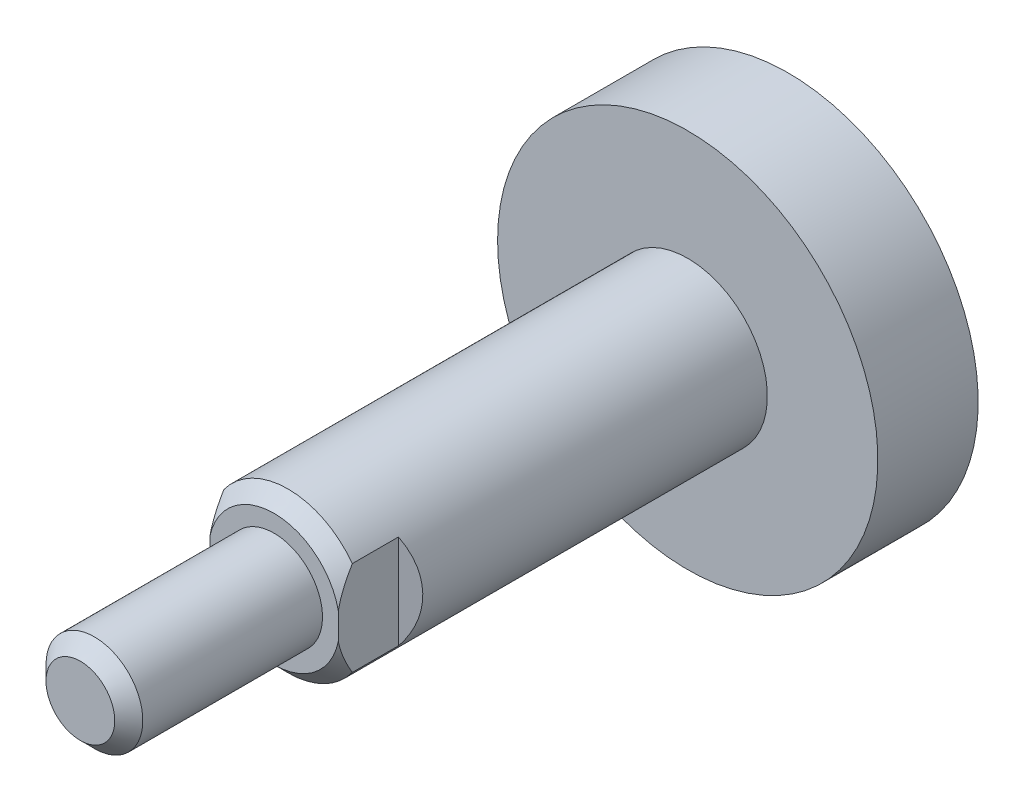
ISO-10303-21;
HEADER;
FILE_DESCRIPTION(('STEP AP214'),'2;1');
FILE_NAME('part.step','',(''),(''),'','','');
FILE_SCHEMA(('AUTOMOTIVE_DESIGN { 1 0 10303 214 1 1 1 1 }'));
ENDSEC;
DATA;
#1=APPLICATION_CONTEXT('core data for automotive mechanical design processes');
#2=APPLICATION_PROTOCOL_DEFINITION('international standard','automotive_design',2000,#1);
#3=PRODUCT_CONTEXT('',#1,'mechanical');
#4=PRODUCT('Part','Part','',(#3));
#5=PRODUCT_RELATED_PRODUCT_CATEGORY('part','',(#4));
#6=PRODUCT_DEFINITION_FORMATION('','',#4);
#7=PRODUCT_DEFINITION_CONTEXT('part definition',#1,'design');
#8=PRODUCT_DEFINITION('design','',#6,#7);
#9=PRODUCT_DEFINITION_SHAPE('','',#8);
#10=(LENGTH_UNIT() NAMED_UNIT(*) SI_UNIT(.MILLI.,.METRE.));
#11=(NAMED_UNIT(*) PLANE_ANGLE_UNIT() SI_UNIT($,.RADIAN.));
#12=(NAMED_UNIT(*) SI_UNIT($,.STERADIAN.) SOLID_ANGLE_UNIT());
#13=UNCERTAINTY_MEASURE_WITH_UNIT(LENGTH_MEASURE(1.E-05),#10,'distance_accuracy_value','');
#14=(GEOMETRIC_REPRESENTATION_CONTEXT(3) GLOBAL_UNCERTAINTY_ASSIGNED_CONTEXT((#13)) GLOBAL_UNIT_ASSIGNED_CONTEXT((#10,
#11,#12)) REPRESENTATION_CONTEXT('',''));
#15=CARTESIAN_POINT('',(0.,0.,0.));
#16=DIRECTION('',(0.,0.,1.));
#17=DIRECTION('',(1.,0.,0.));
#18=AXIS2_PLACEMENT_3D('',#15,#16,#17);
#19=CARTESIAN_POINT('',(0.,0.,35.266));
#20=DIRECTION('',(0.,0.,1.));
#21=DIRECTION('',(1.,0.,0.));
#22=AXIS2_PLACEMENT_3D('',#19,#20,#21);
#23=PLANE('',#22);
#24=CARTESIAN_POINT('',(0.,0.,35.2659999999219));
#25=DIRECTION('',(0.,0.,-1.));
#26=DIRECTION('',(-1.,0.,0.));
#27=AXIS2_PLACEMENT_3D('',#24,#25,#26);
#28=CIRCLE('',#27,1.71299999999519);
#29=CARTESIAN_POINT('',(-1.71299999999519,0.,35.2659999999219));
#30=VERTEX_POINT('',#29);
#31=EDGE_CURVE('E20',#30,#30,#28,.T.);
#32=ORIENTED_EDGE('',*,*,#31,.F.);
#33=EDGE_LOOP('',(#32));
#34=FACE_BOUND('',#33,.T.);
#35=ADVANCED_FACE('F17',(#34),#23,.T.);
#36=CARTESIAN_POINT('',(0.,0.,34.5659999999839));
#37=DIRECTION('',(0.,0.,-1.));
#38=DIRECTION('',(-1.,0.,0.));
#39=AXIS2_PLACEMENT_3D('',#36,#37,#38);
#40=CONICAL_SURFACE('',#39,2.41299999993316,0.785398163397448);
#41=ORIENTED_EDGE('',*,*,#31,.T.);
#42=EDGE_LOOP('',(#41));
#43=FACE_BOUND('',#42,.T.);
#44=CARTESIAN_POINT('',(0.,0.,34.566));
#45=DIRECTION('',(0.,0.,-1.));
#46=DIRECTION('',(-1.,0.,0.));
#47=AXIS2_PLACEMENT_3D('',#44,#45,#46);
#48=CIRCLE('',#47,2.413);
#49=CARTESIAN_POINT('',(-2.413,0.,34.566));
#50=VERTEX_POINT('',#49);
#51=EDGE_CURVE('E72',#50,#50,#48,.T.);
#52=ORIENTED_EDGE('',*,*,#51,.F.);
#53=EDGE_LOOP('',(#52));
#54=FACE_BOUND('',#53,.T.);
#55=ADVANCED_FACE('F197',(#43,#54),#40,.T.);
#56=CARTESIAN_POINT('',(0.,0.,35.266));
#57=DIRECTION('',(0.,0.,-1.));
#58=DIRECTION('',(-1.,0.,0.));
#59=AXIS2_PLACEMENT_3D('',#56,#57,#58);
#60=CYLINDRICAL_SURFACE('',#59,2.413);
#61=ORIENTED_EDGE('',*,*,#51,.T.);
#62=EDGE_LOOP('',(#61));
#63=FACE_BOUND('',#62,.T.);
#64=CARTESIAN_POINT('',(0.,0.,25.614));
#65=DIRECTION('',(0.,0.,-1.));
#66=DIRECTION('',(-1.,0.,0.));
#67=AXIS2_PLACEMENT_3D('',#64,#65,#66);
#68=CIRCLE('',#67,2.413);
#69=CARTESIAN_POINT('',(-2.413,0.,25.614));
#70=VERTEX_POINT('',#69);
#71=EDGE_CURVE('E71',#70,#70,#68,.F.);
#72=ORIENTED_EDGE('',*,*,#71,.T.);
#73=EDGE_LOOP('',(#72));
#74=FACE_BOUND('',#73,.T.);
#75=ADVANCED_FACE('F205',(#63,#74),#60,.T.);
#76=CARTESIAN_POINT('',(0.,0.,25.614));
#77=DIRECTION('',(0.,0.,-1.));
#78=DIRECTION('',(-1.,0.,0.));
#79=AXIS2_PLACEMENT_3D('',#76,#77,#78);
#80=PLANE('',#79);
#81=ORIENTED_EDGE('',*,*,#71,.F.);
#82=EDGE_LOOP('',(#81));
#83=FACE_BOUND('',#82,.T.);
#84=DIRECTION('',(0.,1.,0.));
#85=VECTOR('',#84,1.);
#86=CARTESIAN_POINT('',(3.2,0.,25.614));
#87=LINE('',#86,#85);
#88=CARTESIAN_POINT('',(3.2,0.668102537031743,25.6140000000093));
#89=VERTEX_POINT('',#88);
#90=CARTESIAN_POINT('',(3.2,-0.668102537031746,25.6140000000093));
#91=VERTEX_POINT('',#90);
#92=EDGE_CURVE('E59',#89,#91,#87,.F.);
#93=ORIENTED_EDGE('',*,*,#92,.F.);
#94=CARTESIAN_POINT('',(0.,0.,25.6140000000187));
#95=DIRECTION('',(0.,0.,-1.));
#96=DIRECTION('',(0.,1.,0.));
#97=AXIS2_PLACEMENT_3D('',#94,#95,#96);
#98=CIRCLE('',#97,3.26899999998886);
#99=CARTESIAN_POINT('',(-3.2,0.668102537031739,25.6140000000093));
#100=VERTEX_POINT('',#99);
#101=EDGE_CURVE('E92',#100,#89,#98,.T.);
#102=ORIENTED_EDGE('',*,*,#101,.F.);
#103=DIRECTION('',(0.,1.,0.));
#104=VECTOR('',#103,1.);
#105=CARTESIAN_POINT('',(-3.2,-9.475,25.614));
#106=LINE('',#105,#104);
#107=CARTESIAN_POINT('',(-3.2,-0.668102537013467,25.6140000000131));
#108=VERTEX_POINT('',#107);
#109=EDGE_CURVE('E78',#100,#108,#106,.F.);
#110=ORIENTED_EDGE('',*,*,#109,.T.);
#111=CARTESIAN_POINT('',(0.,0.,25.6140000000187));
#112=DIRECTION('',(0.,0.,-1.));
#113=DIRECTION('',(0.,1.,0.));
#114=AXIS2_PLACEMENT_3D('',#111,#112,#113);
#115=CIRCLE('',#114,3.26899999998886);
#116=EDGE_CURVE('E76',#91,#108,#115,.T.);
#117=ORIENTED_EDGE('',*,*,#116,.F.);
#118=EDGE_LOOP('',(#93,#102,#110,#117));
#119=FACE_BOUND('',#118,.T.);
#120=ADVANCED_FACE('F77',(#83,#119),#80,.F.);
#121=CARTESIAN_POINT('',(0.,0.,24.9140000000807));
#122=DIRECTION('',(0.,0.,-1.));
#123=DIRECTION('',(0.,1.,0.));
#124=AXIS2_PLACEMENT_3D('',#121,#122,#123);
#125=CONICAL_SURFACE('',#124,3.96899999992684,0.785398163397448);
#126=CARTESIAN_POINT('',(-3.2,-0.668102537040882,25.6140000000075));
#127=CARTESIAN_POINT('',(-3.2,-0.791923989295431,25.5887118948215));
#128=CARTESIAN_POINT('',(-3.2,-0.914214432178694,25.5569533814341));
#129=CARTESIAN_POINT('',(-3.2,-1.15522323064115,25.4827867348097));
#130=CARTESIAN_POINT('',(-3.2,-1.27394966581365,25.4404051094269));
#131=CARTESIAN_POINT('',(-3.2,-1.50692397326224,25.3475394481761));
#132=CARTESIAN_POINT('',(-3.2,-1.62120166832553,25.2971285477306));
#133=CARTESIAN_POINT('',(-3.2,-1.84665634636373,25.1897204575844));
#134=CARTESIAN_POINT('',(-3.2,-1.95783200279579,25.1327205021723));
#135=CARTESIAN_POINT('',(-3.2,-2.11477722577384,25.0475447828539));
#136=CARTESIAN_POINT('',(-3.2,-2.16170136236511,25.0214620111321));
#137=CARTESIAN_POINT('',(-3.2,-2.25515024750114,24.9683835316657));
#138=CARTESIAN_POINT('',(-3.2,-2.30167405354124,24.9413861634533));
#139=CARTESIAN_POINT('',(-3.2,-2.3479695483578,24.9140000000056));
#140=B_SPLINE_CURVE_WITH_KNOTS('',3,(#126,#127,#128,#129,#130,#131,#132,#133,#134,#135,#136,
#137,#138,#139),.UNSPECIFIED.,.F.,.F.,(4,2,2,2,2,2,4),(0.,0.378663318902456,0.756391005201611,
1.13085654272106,1.50547983428745,1.66653163358814,1.82789340191388),.UNSPECIFIED.);
#141=CARTESIAN_POINT('',(-3.2,-2.34796954835615,24.9140000000028));
#142=VERTEX_POINT('',#141);
#143=EDGE_CURVE('E117',#108,#142,#140,.T.);
#144=ORIENTED_EDGE('',*,*,#143,.T.);
#145=CARTESIAN_POINT('',(0.,0.,24.914));
#146=DIRECTION('',(0.,0.,-1.));
#147=DIRECTION('',(-1.,0.,0.));
#148=AXIS2_PLACEMENT_3D('',#145,#146,#147);
#149=CIRCLE('',#148,3.969);
#150=CARTESIAN_POINT('',(3.2,-2.34796954835615,24.9140000000028));
#151=VERTEX_POINT('',#150);
#152=EDGE_CURVE('E86',#151,#142,#149,.T.);
#153=ORIENTED_EDGE('',*,*,#152,.F.);
#154=CARTESIAN_POINT('',(3.2,-2.3479695483578,24.9140000000056));
#155=CARTESIAN_POINT('',(3.2,-2.28227540636544,24.9528576848515));
#156=CARTESIAN_POINT('',(3.2,-2.21612013327484,24.9909397042059));
#157=CARTESIAN_POINT('',(3.2,-2.08277615456898,25.0652931600532));
#158=CARTESIAN_POINT('',(3.2,-2.01558715528862,25.1015640691339));
#159=CARTESIAN_POINT('',(3.2,-1.81330543749889,25.2067462963329));
#160=CARTESIAN_POINT('',(3.2,-1.67658349378557,25.2725768397095));
#161=CARTESIAN_POINT('',(3.2,-1.39788707533628,25.3932563066724));
#162=CARTESIAN_POINT('',(3.2,-1.25590184063826,25.4480810761766));
#163=CARTESIAN_POINT('',(3.2,-0.966123687789929,25.543157171903));
#164=CARTESIAN_POINT('',(3.2,-0.818297789803382,25.5833066541195));
#165=CARTESIAN_POINT('',(3.2,-0.668102537040855,25.6140000000075));
#166=B_SPLINE_CURVE_WITH_KNOTS('',3,(#154,#155,#156,#157,#158,#159,#160,#161,#162,#163,#164,
#165),.UNSPECIFIED.,.F.,.F.,(4,2,2,2,2,4),(0.,0.228972156487761,0.458010607517,
0.912891486437007,1.36876002116515,1.82773469580356),.UNSPECIFIED.);
#167=EDGE_CURVE('E64',#151,#91,#166,.T.);
#168=ORIENTED_EDGE('',*,*,#167,.T.);
#169=ORIENTED_EDGE('',*,*,#116,.T.);
#170=EDGE_LOOP('',(#144,#153,#168,#169));
#171=FACE_BOUND('',#170,.T.);
#172=ADVANCED_FACE('F85',(#171),#125,.T.);
#173=CARTESIAN_POINT('',(3.2,-9.475,22.614));
#174=DIRECTION('',(-0.500000000000005,0.,-0.866025403784436));
#175=DIRECTION('',(-0.866025403784436,0.,0.500000000000005));
#176=AXIS2_PLACEMENT_3D('',#173,#174,#175);
#177=PLANE('',#176);
#178=CARTESIAN_POINT('',(0.,0.,24.4615208614068));
#179=DIRECTION('',(-0.500000000000005,0.,-0.866025403784436));
#180=DIRECTION('',(0.866025403784436,0.,-0.500000000000005));
#181=AXIS2_PLACEMENT_3D('',#178,#179,#180);
#182=ELLIPSE('',#181,4.58300643682726,3.969);
#183=CARTESIAN_POINT('',(3.2,2.34796954835449,22.614));
#184=VERTEX_POINT('',#183);
#185=CARTESIAN_POINT('',(3.2,-2.34796954835449,22.614));
#186=VERTEX_POINT('',#185);
#187=EDGE_CURVE('E176',#184,#186,#182,.T.);
#188=ORIENTED_EDGE('',*,*,#187,.F.);
#189=DIRECTION('',(0.,1.,0.));
#190=VECTOR('',#189,1.);
#191=CARTESIAN_POINT('',(3.2,-9.475,22.614));
#192=LINE('',#191,#190);
#193=EDGE_CURVE('E87',#184,#186,#192,.F.);
#194=ORIENTED_EDGE('',*,*,#193,.T.);
#195=EDGE_LOOP('',(#188,#194));
#196=FACE_BOUND('',#195,.T.);
#197=ADVANCED_FACE('F112',(#196),#177,.F.);
#198=CARTESIAN_POINT('',(-3.2,-9.475,22.614));
#199=DIRECTION('',(0.500000000000003,0.,-0.866025403784437));
#200=DIRECTION('',(-0.866025403784437,0.,-0.500000000000003));
#201=AXIS2_PLACEMENT_3D('',#198,#199,#200);
#202=PLANE('',#201);
#203=CARTESIAN_POINT('',(0.,0.,24.4615208614068));
#204=DIRECTION('',(0.500000000000003,0.,-0.866025403784437));
#205=DIRECTION('',(-0.866025403784437,0.,-0.500000000000003));
#206=AXIS2_PLACEMENT_3D('',#203,#204,#205);
#207=ELLIPSE('',#206,4.58300643682726,3.969);
#208=CARTESIAN_POINT('',(-3.2,-2.34796954835449,22.614));
#209=VERTEX_POINT('',#208);
#210=CARTESIAN_POINT('',(-3.2,2.34796954835449,22.614));
#211=VERTEX_POINT('',#210);
#212=EDGE_CURVE('E173',#209,#211,#207,.T.);
#213=ORIENTED_EDGE('',*,*,#212,.F.);
#214=DIRECTION('',(0.,1.,0.));
#215=VECTOR('',#214,1.);
#216=CARTESIAN_POINT('',(-3.2,-9.475,22.614));
#217=LINE('',#216,#215);
#218=EDGE_CURVE('E82',#209,#211,#217,.T.);
#219=ORIENTED_EDGE('',*,*,#218,.T.);
#220=EDGE_LOOP('',(#213,#219));
#221=FACE_BOUND('',#220,.T.);
#222=ADVANCED_FACE('F130',(#221),#202,.F.);
#223=CARTESIAN_POINT('',(-3.2,-9.475,25.614));
#224=DIRECTION('',(1.,0.,0.));
#225=DIRECTION('',(0.,0.,-1.));
#226=AXIS2_PLACEMENT_3D('',#223,#224,#225);
#227=PLANE('',#226);
#228=ORIENTED_EDGE('',*,*,#143,.F.);
#229=ORIENTED_EDGE('',*,*,#109,.F.);
#230=CARTESIAN_POINT('',(-3.2,2.34796954835962,24.9140000000045));
#231=CARTESIAN_POINT('',(-3.2,2.28227540636707,24.9528576848505));
#232=CARTESIAN_POINT('',(-3.2,2.21612013327628,24.9909397042051));
#233=CARTESIAN_POINT('',(-3.2,2.08277615457002,25.0652931600527));
#234=CARTESIAN_POINT('',(-3.2,2.01558715528946,25.1015640691335));
#235=CARTESIAN_POINT('',(-3.2,1.81330543749913,25.2067462963328));
#236=CARTESIAN_POINT('',(-3.2,1.6765834937854,25.2725768397096));
#237=CARTESIAN_POINT('',(-3.2,1.39788707533526,25.3932563066728));
#238=CARTESIAN_POINT('',(-3.2,1.25590184063679,25.4480810761771));
#239=CARTESIAN_POINT('',(-3.2,0.966123687787529,25.5431571719037));
#240=CARTESIAN_POINT('',(-3.2,0.818297789800499,25.5833066541203));
#241=CARTESIAN_POINT('',(-3.2,0.668102537037478,25.6140000000082));
#242=B_SPLINE_CURVE_WITH_KNOTS('',3,(#230,#231,#232,#233,#234,#235,#236,#237,#238,#239,#240,
#241),.UNSPECIFIED.,.F.,.F.,(4,2,2,2,2,4),(0.,0.228972156488459,0.458010607518399,
0.912891486439775,1.3687600211693,1.82773469580912),.UNSPECIFIED.);
#243=CARTESIAN_POINT('',(-3.2,2.34796954835449,24.9140000000038));
#244=VERTEX_POINT('',#243);
#245=EDGE_CURVE('E122',#244,#100,#242,.T.);
#246=ORIENTED_EDGE('',*,*,#245,.F.);
#247=DIRECTION('',(0.,0.,-1.));
#248=VECTOR('',#247,1.);
#249=CARTESIAN_POINT('',(-3.2,2.34796954835449,36.8400272581176));
#250=LINE('',#249,#248);
#251=EDGE_CURVE('E175',#211,#244,#250,.F.);
#252=ORIENTED_EDGE('',*,*,#251,.F.);
#253=ORIENTED_EDGE('',*,*,#218,.F.);
#254=DIRECTION('',(0.,0.,-1.));
#255=VECTOR('',#254,1.);
#256=CARTESIAN_POINT('',(-3.2,-2.34796954835449,36.8400272581176));
#257=LINE('',#256,#255);
#258=EDGE_CURVE('E178',#142,#209,#257,.T.);
#259=ORIENTED_EDGE('',*,*,#258,.F.);
#260=EDGE_LOOP('',(#228,#229,#246,#252,#253,#259));
#261=FACE_BOUND('',#260,.T.);
#262=ADVANCED_FACE('F126',(#261),#227,.F.);
#263=CARTESIAN_POINT('',(0.,0.,24.9140000000807));
#264=DIRECTION('',(0.,0.,-1.));
#265=DIRECTION('',(0.,1.,0.));
#266=AXIS2_PLACEMENT_3D('',#263,#264,#265);
#267=CONICAL_SURFACE('',#266,3.96899999992684,0.785398163397448);
#268=ORIENTED_EDGE('',*,*,#245,.T.);
#269=ORIENTED_EDGE('',*,*,#101,.T.);
#270=CARTESIAN_POINT('',(3.2,0.668102537040886,25.6140000000075));
#271=CARTESIAN_POINT('',(3.2,0.791923989295436,25.5887118948215));
#272=CARTESIAN_POINT('',(3.2,0.914214432178698,25.5569533814341));
#273=CARTESIAN_POINT('',(3.2,1.15522323064116,25.4827867348097));
#274=CARTESIAN_POINT('',(3.2,1.27394966581365,25.4404051094269));
#275=CARTESIAN_POINT('',(3.2,1.50692397326225,25.3475394481761));
#276=CARTESIAN_POINT('',(3.2,1.62120166832553,25.2971285477306));
#277=CARTESIAN_POINT('',(3.2,1.84665634636373,25.1897204575844));
#278=CARTESIAN_POINT('',(3.2,1.9578320027958,25.1327205021723));
#279=CARTESIAN_POINT('',(3.2,2.11477722577385,25.0475447828539));
#280=CARTESIAN_POINT('',(3.2,2.16170136236511,25.0214620111321));
#281=CARTESIAN_POINT('',(3.2,2.25515024750115,24.9683835316657));
#282=CARTESIAN_POINT('',(3.2,2.30167405354124,24.9413861634533));
#283=CARTESIAN_POINT('',(3.2,2.3479695483578,24.9140000000056));
#284=B_SPLINE_CURVE_WITH_KNOTS('',3,(#270,#271,#272,#273,#274,#275,#276,#277,#278,#279,#280,
#281,#282,#283),.UNSPECIFIED.,.F.,.F.,(4,2,2,2,2,2,4),(0.,0.378663318902456,0.756391005201611,
1.13085654272106,1.50547983428745,1.66653163358814,1.82789340191388),.UNSPECIFIED.);
#285=CARTESIAN_POINT('',(3.2,2.34796954835615,24.9140000000028));
#286=VERTEX_POINT('',#285);
#287=EDGE_CURVE('E67',#89,#286,#284,.T.);
#288=ORIENTED_EDGE('',*,*,#287,.T.);
#289=CARTESIAN_POINT('',(0.,0.,24.914));
#290=DIRECTION('',(0.,0.,-1.));
#291=DIRECTION('',(-1.,0.,0.));
#292=AXIS2_PLACEMENT_3D('',#289,#290,#291);
#293=CIRCLE('',#292,3.969);
#294=EDGE_CURVE('E35',#244,#286,#293,.T.);
#295=ORIENTED_EDGE('',*,*,#294,.F.);
#296=EDGE_LOOP('',(#268,#269,#288,#295));
#297=FACE_BOUND('',#296,.T.);
#298=ADVANCED_FACE('F129',(#297),#267,.T.);
#299=CARTESIAN_POINT('',(3.2,-9.475,25.614));
#300=DIRECTION('',(-1.,0.,0.));
#301=DIRECTION('',(0.,0.,1.));
#302=AXIS2_PLACEMENT_3D('',#299,#300,#301);
#303=PLANE('',#302);
#304=ORIENTED_EDGE('',*,*,#287,.F.);
#305=ORIENTED_EDGE('',*,*,#92,.T.);
#306=ORIENTED_EDGE('',*,*,#167,.F.);
#307=DIRECTION('',(0.,0.,-1.));
#308=VECTOR('',#307,1.);
#309=CARTESIAN_POINT('',(3.2,-2.34796954835449,36.8400272581176));
#310=LINE('',#309,#308);
#311=EDGE_CURVE('E89',#186,#151,#310,.F.);
#312=ORIENTED_EDGE('',*,*,#311,.F.);
#313=ORIENTED_EDGE('',*,*,#193,.F.);
#314=DIRECTION('',(0.,0.,-1.));
#315=VECTOR('',#314,1.);
#316=CARTESIAN_POINT('',(3.2,2.3479695483545,36.8400272581176));
#317=LINE('',#316,#315);
#318=EDGE_CURVE('E167',#286,#184,#317,.T.);
#319=ORIENTED_EDGE('',*,*,#318,.F.);
#320=EDGE_LOOP('',(#304,#305,#306,#312,#313,#319));
#321=FACE_BOUND('',#320,.T.);
#322=ADVANCED_FACE('F61',(#321),#303,.F.);
#323=CARTESIAN_POINT('',(0.,0.,36.8400272581176));
#324=DIRECTION('',(0.,0.,-1.));
#325=DIRECTION('',(-1.,0.,0.));
#326=AXIS2_PLACEMENT_3D('',#323,#324,#325);
#327=CYLINDRICAL_SURFACE('',#326,3.969);
#328=CARTESIAN_POINT('',(0.,0.,5.));
#329=DIRECTION('',(0.,0.,-1.));
#330=DIRECTION('',(-1.,0.,0.));
#331=AXIS2_PLACEMENT_3D('',#328,#329,#330);
#332=CIRCLE('',#331,3.969);
#333=CARTESIAN_POINT('',(-3.969,0.,5.));
#334=VERTEX_POINT('',#333);
#335=EDGE_CURVE('E165',#334,#334,#332,.T.);
#336=ORIENTED_EDGE('',*,*,#335,.F.);
#337=EDGE_LOOP('',(#336));
#338=FACE_BOUND('',#337,.T.);
#339=ORIENTED_EDGE('',*,*,#294,.T.);
#340=ORIENTED_EDGE('',*,*,#318,.T.);
#341=ORIENTED_EDGE('',*,*,#187,.T.);
#342=ORIENTED_EDGE('',*,*,#311,.T.);
#343=ORIENTED_EDGE('',*,*,#152,.T.);
#344=ORIENTED_EDGE('',*,*,#258,.T.);
#345=ORIENTED_EDGE('',*,*,#212,.T.);
#346=ORIENTED_EDGE('',*,*,#251,.T.);
#347=EDGE_LOOP('',(#339,#340,#341,#342,#343,#344,#345,#346));
#348=FACE_BOUND('',#347,.T.);
#349=ADVANCED_FACE('F156',(#338,#348),#327,.T.);
#350=CARTESIAN_POINT('',(0.,0.,5.));
#351=DIRECTION('',(0.,0.,1.));
#352=DIRECTION('',(1.,0.,0.));
#353=AXIS2_PLACEMENT_3D('',#350,#351,#352);
#354=PLANE('',#353);
#355=CARTESIAN_POINT('',(0.,0.,5.));
#356=DIRECTION('',(0.,0.,-1.));
#357=DIRECTION('',(-1.,0.,0.));
#358=AXIS2_PLACEMENT_3D('',#355,#356,#357);
#359=CIRCLE('',#358,9.475);
#360=CARTESIAN_POINT('',(-9.475,0.,5.));
#361=VERTEX_POINT('',#360);
#362=EDGE_CURVE('E26',#361,#361,#359,.T.);
#363=ORIENTED_EDGE('',*,*,#362,.F.);
#364=EDGE_LOOP('',(#363));
#365=FACE_BOUND('',#364,.T.);
#366=ORIENTED_EDGE('',*,*,#335,.T.);
#367=EDGE_LOOP('',(#366));
#368=FACE_BOUND('',#367,.T.);
#369=ADVANCED_FACE('F150',(#365,#368),#354,.T.);
#370=CARTESIAN_POINT('',(0.,0.,5.));
#371=DIRECTION('',(0.,0.,-1.));
#372=DIRECTION('',(-1.,0.,0.));
#373=AXIS2_PLACEMENT_3D('',#370,#371,#372);
#374=CYLINDRICAL_SURFACE('',#373,9.475);
#375=ORIENTED_EDGE('',*,*,#362,.T.);
#376=EDGE_LOOP('',(#375));
#377=FACE_BOUND('',#376,.T.);
#378=CARTESIAN_POINT('',(0.,0.,0.));
#379=DIRECTION('',(0.,0.,-1.));
#380=DIRECTION('',(-1.,0.,0.));
#381=AXIS2_PLACEMENT_3D('',#378,#379,#380);
#382=CIRCLE('',#381,9.475);
#383=CARTESIAN_POINT('',(-9.475,0.,0.));
#384=VERTEX_POINT('',#383);
#385=EDGE_CURVE('E11',#384,#384,#382,.F.);
#386=ORIENTED_EDGE('',*,*,#385,.T.);
#387=EDGE_LOOP('',(#386));
#388=FACE_BOUND('',#387,.T.);
#389=ADVANCED_FACE('F144',(#377,#388),#374,.T.);
#390=CARTESIAN_POINT('',(0.,0.,0.));
#391=DIRECTION('',(0.,0.,1.));
#392=DIRECTION('',(1.,0.,0.));
#393=AXIS2_PLACEMENT_3D('',#390,#391,#392);
#394=PLANE('',#393);
#395=ORIENTED_EDGE('',*,*,#385,.F.);
#396=EDGE_LOOP('',(#395));
#397=FACE_BOUND('',#396,.T.);
#398=ADVANCED_FACE('F142',(#397),#394,.F.);
#399=CLOSED_SHELL('',(#35,#55,#75,#120,#172,#197,#222,#262,#298,#322,#349,#369,#389,#398));
#400=MANIFOLD_SOLID_BREP('B1',#399);
#401=ADVANCED_BREP_SHAPE_REPRESENTATION('',(#18,#400),#14);
#402=SHAPE_DEFINITION_REPRESENTATION(#9,#401);
ENDSEC;
END-ISO-10303-21;
